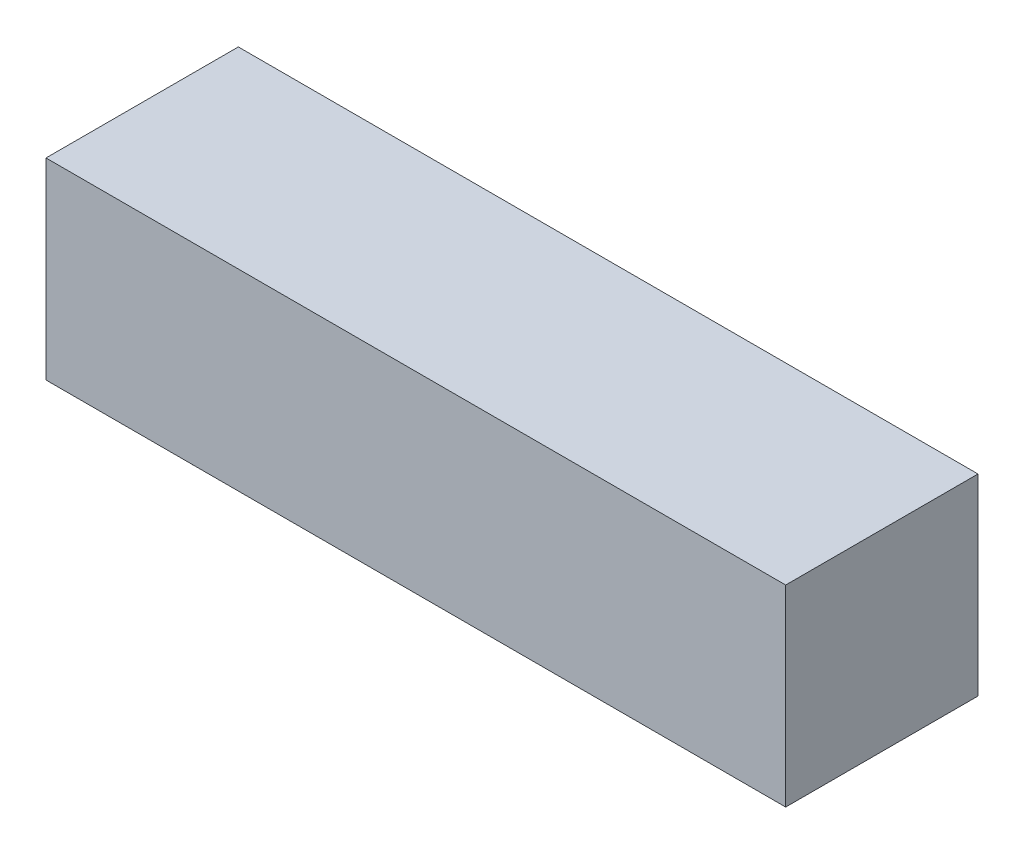
ISO-10303-21;
HEADER;
FILE_DESCRIPTION(('STEP AP214'),'2;1');
FILE_NAME('part.step','',(''),(''),'','','');
FILE_SCHEMA(('AUTOMOTIVE_DESIGN { 1 0 10303 214 1 1 1 1 }'));
ENDSEC;
DATA;
#1=APPLICATION_CONTEXT('core data for automotive mechanical design processes');
#2=APPLICATION_PROTOCOL_DEFINITION('international standard','automotive_design',2000,#1);
#3=PRODUCT_CONTEXT('',#1,'mechanical');
#4=PRODUCT('Part','Part','',(#3));
#5=PRODUCT_RELATED_PRODUCT_CATEGORY('part','',(#4));
#6=PRODUCT_DEFINITION_FORMATION('','',#4);
#7=PRODUCT_DEFINITION_CONTEXT('part definition',#1,'design');
#8=PRODUCT_DEFINITION('design','',#6,#7);
#9=PRODUCT_DEFINITION_SHAPE('','',#8);
#10=(LENGTH_UNIT() NAMED_UNIT(*) SI_UNIT(.MILLI.,.METRE.));
#11=(NAMED_UNIT(*) PLANE_ANGLE_UNIT() SI_UNIT($,.RADIAN.));
#12=(NAMED_UNIT(*) SI_UNIT($,.STERADIAN.) SOLID_ANGLE_UNIT());
#13=UNCERTAINTY_MEASURE_WITH_UNIT(LENGTH_MEASURE(1.E-05),#10,'distance_accuracy_value','');
#14=(GEOMETRIC_REPRESENTATION_CONTEXT(3) GLOBAL_UNCERTAINTY_ASSIGNED_CONTEXT((#13)) GLOBAL_UNIT_ASSIGNED_CONTEXT((#10,
#11,#12)) REPRESENTATION_CONTEXT('',''));
#15=CARTESIAN_POINT('',(0.,0.,0.));
#16=DIRECTION('',(0.,0.,1.));
#17=DIRECTION('',(1.,0.,0.));
#18=AXIS2_PLACEMENT_3D('',#15,#16,#17);
#19=CARTESIAN_POINT('',(-22.6998290509739,11.3110236220472,13.));
#20=DIRECTION('',(1.,0.,0.));
#21=DIRECTION('',(0.,0.,-1.));
#22=AXIS2_PLACEMENT_3D('',#19,#20,#21);
#23=PLANE('',#22);
#24=DIRECTION('',(0.,-1.,0.));
#25=VECTOR('',#24,1.);
#26=CARTESIAN_POINT('',(-22.6998290509739,11.3110236220472,0.));
#27=LINE('',#26,#25);
#28=CARTESIAN_POINT('',(-22.6998290509739,11.3110236220472,0.));
#29=VERTEX_POINT('',#28);
#30=CARTESIAN_POINT('',(-22.6998290509739,-1.68897637795275,0.));
#31=VERTEX_POINT('',#30);
#32=EDGE_CURVE('E96',#29,#31,#27,.T.);
#33=ORIENTED_EDGE('',*,*,#32,.T.);
#34=DIRECTION('',(0.,0.,-1.));
#35=VECTOR('',#34,1.);
#36=CARTESIAN_POINT('',(-22.6998290509739,-1.68897637795275,13.));
#37=LINE('',#36,#35);
#38=CARTESIAN_POINT('',(-22.6998290509739,-1.68897637795275,13.));
#39=VERTEX_POINT('',#38);
#40=EDGE_CURVE('E11',#39,#31,#37,.T.);
#41=ORIENTED_EDGE('',*,*,#40,.F.);
#42=DIRECTION('',(0.,-1.,0.));
#43=VECTOR('',#42,1.);
#44=CARTESIAN_POINT('',(-22.6998290509739,11.3110236220472,13.));
#45=LINE('',#44,#43);
#46=CARTESIAN_POINT('',(-22.6998290509739,11.3110236220472,13.));
#47=VERTEX_POINT('',#46);
#48=EDGE_CURVE('E84',#47,#39,#45,.T.);
#49=ORIENTED_EDGE('',*,*,#48,.F.);
#50=DIRECTION('',(0.,0.,-1.));
#51=VECTOR('',#50,1.);
#52=CARTESIAN_POINT('',(-22.6998290509739,11.3110236220472,13.));
#53=LINE('',#52,#51);
#54=EDGE_CURVE('E92',#47,#29,#53,.T.);
#55=ORIENTED_EDGE('',*,*,#54,.T.);
#56=EDGE_LOOP('',(#33,#41,#49,#55));
#57=FACE_BOUND('',#56,.T.);
#58=ADVANCED_FACE('F33',(#57),#23,.F.);
#59=CARTESIAN_POINT('',(-22.6998290509739,-1.68897637795275,13.));
#60=DIRECTION('',(0.,1.,0.));
#61=DIRECTION('',(-1.,0.,0.));
#62=AXIS2_PLACEMENT_3D('',#59,#60,#61);
#63=PLANE('',#62);
#64=DIRECTION('',(1.,0.,0.));
#65=VECTOR('',#64,1.);
#66=CARTESIAN_POINT('',(-22.6998290509739,-1.68897637795275,0.));
#67=LINE('',#66,#65);
#68=CARTESIAN_POINT('',(27.3001709490261,-1.68897637795275,0.));
#69=VERTEX_POINT('',#68);
#70=EDGE_CURVE('E88',#31,#69,#67,.T.);
#71=ORIENTED_EDGE('',*,*,#70,.T.);
#72=DIRECTION('',(0.,0.,-1.));
#73=VECTOR('',#72,1.);
#74=CARTESIAN_POINT('',(27.3001709490261,-1.68897637795275,13.));
#75=LINE('',#74,#73);
#76=CARTESIAN_POINT('',(27.3001709490261,-1.68897637795275,13.));
#77=VERTEX_POINT('',#76);
#78=EDGE_CURVE('E41',#77,#69,#75,.T.);
#79=ORIENTED_EDGE('',*,*,#78,.F.);
#80=DIRECTION('',(1.,0.,0.));
#81=VECTOR('',#80,1.);
#82=CARTESIAN_POINT('',(-22.6998290509739,-1.68897637795275,13.));
#83=LINE('',#82,#81);
#84=EDGE_CURVE('E79',#39,#77,#83,.T.);
#85=ORIENTED_EDGE('',*,*,#84,.F.);
#86=ORIENTED_EDGE('',*,*,#40,.T.);
#87=EDGE_LOOP('',(#71,#79,#85,#86));
#88=FACE_BOUND('',#87,.T.);
#89=ADVANCED_FACE('F87',(#88),#63,.F.);
#90=CARTESIAN_POINT('',(27.3001709490261,11.3110236220472,13.));
#91=DIRECTION('',(-1.,0.,0.));
#92=DIRECTION('',(0.,0.,1.));
#93=AXIS2_PLACEMENT_3D('',#90,#91,#92);
#94=PLANE('',#93);
#95=DIRECTION('',(0.,1.,0.));
#96=VECTOR('',#95,1.);
#97=CARTESIAN_POINT('',(27.3001709490261,11.3110236220472,0.));
#98=LINE('',#97,#96);
#99=CARTESIAN_POINT('',(27.3001709490261,11.3110236220472,0.));
#100=VERTEX_POINT('',#99);
#101=EDGE_CURVE('E66',#69,#100,#98,.T.);
#102=ORIENTED_EDGE('',*,*,#101,.T.);
#103=DIRECTION('',(0.,0.,-1.));
#104=VECTOR('',#103,1.);
#105=CARTESIAN_POINT('',(27.3001709490261,11.3110236220472,13.));
#106=LINE('',#105,#104);
#107=CARTESIAN_POINT('',(27.3001709490261,11.3110236220472,13.));
#108=VERTEX_POINT('',#107);
#109=EDGE_CURVE('E89',#108,#100,#106,.T.);
#110=ORIENTED_EDGE('',*,*,#109,.F.);
#111=DIRECTION('',(0.,1.,0.));
#112=VECTOR('',#111,1.);
#113=CARTESIAN_POINT('',(27.3001709490261,11.3110236220472,13.));
#114=LINE('',#113,#112);
#115=EDGE_CURVE('E82',#77,#108,#114,.T.);
#116=ORIENTED_EDGE('',*,*,#115,.F.);
#117=ORIENTED_EDGE('',*,*,#78,.T.);
#118=EDGE_LOOP('',(#102,#110,#116,#117));
#119=FACE_BOUND('',#118,.T.);
#120=ADVANCED_FACE('F90',(#119),#94,.F.);
#121=CARTESIAN_POINT('',(-22.6998290509739,11.3110236220472,13.));
#122=DIRECTION('',(0.,-1.,0.));
#123=DIRECTION('',(0.,0.,-1.));
#124=AXIS2_PLACEMENT_3D('',#121,#122,#123);
#125=PLANE('',#124);
#126=DIRECTION('',(-1.,0.,0.));
#127=VECTOR('',#126,1.);
#128=CARTESIAN_POINT('',(-22.6998290509739,11.3110236220472,0.));
#129=LINE('',#128,#127);
#130=EDGE_CURVE('E72',#100,#29,#129,.T.);
#131=ORIENTED_EDGE('',*,*,#130,.T.);
#132=ORIENTED_EDGE('',*,*,#54,.F.);
#133=DIRECTION('',(-1.,0.,0.));
#134=VECTOR('',#133,1.);
#135=CARTESIAN_POINT('',(-22.6998290509739,11.3110236220472,13.));
#136=LINE('',#135,#134);
#137=EDGE_CURVE('E49',#108,#47,#136,.T.);
#138=ORIENTED_EDGE('',*,*,#137,.F.);
#139=ORIENTED_EDGE('',*,*,#109,.T.);
#140=EDGE_LOOP('',(#131,#132,#138,#139));
#141=FACE_BOUND('',#140,.T.);
#142=ADVANCED_FACE('F103',(#141),#125,.F.);
#143=CARTESIAN_POINT('',(0.,0.,13.));
#144=DIRECTION('',(0.,0.,1.));
#145=DIRECTION('',(1.,0.,0.));
#146=AXIS2_PLACEMENT_3D('',#143,#144,#145);
#147=PLANE('',#146);
#148=ORIENTED_EDGE('',*,*,#48,.T.);
#149=ORIENTED_EDGE('',*,*,#84,.T.);
#150=ORIENTED_EDGE('',*,*,#115,.T.);
#151=ORIENTED_EDGE('',*,*,#137,.T.);
#152=EDGE_LOOP('',(#148,#149,#150,#151));
#153=FACE_BOUND('',#152,.T.);
#154=ADVANCED_FACE('F80',(#153),#147,.T.);
#155=CARTESIAN_POINT('',(0.,0.,0.));
#156=DIRECTION('',(0.,0.,1.));
#157=DIRECTION('',(1.,0.,0.));
#158=AXIS2_PLACEMENT_3D('',#155,#156,#157);
#159=PLANE('',#158);
#160=ORIENTED_EDGE('',*,*,#32,.F.);
#161=ORIENTED_EDGE('',*,*,#130,.F.);
#162=ORIENTED_EDGE('',*,*,#101,.F.);
#163=ORIENTED_EDGE('',*,*,#70,.F.);
#164=EDGE_LOOP('',(#160,#161,#162,#163));
#165=FACE_BOUND('',#164,.T.);
#166=ADVANCED_FACE('F106',(#165),#159,.F.);
#167=CLOSED_SHELL('',(#58,#89,#120,#142,#154,#166));
#168=MANIFOLD_SOLID_BREP('B2',#167);
#169=ADVANCED_BREP_SHAPE_REPRESENTATION('',(#18,#168),#14);
#170=SHAPE_DEFINITION_REPRESENTATION(#9,#169);
ENDSEC;
END-ISO-10303-21;
